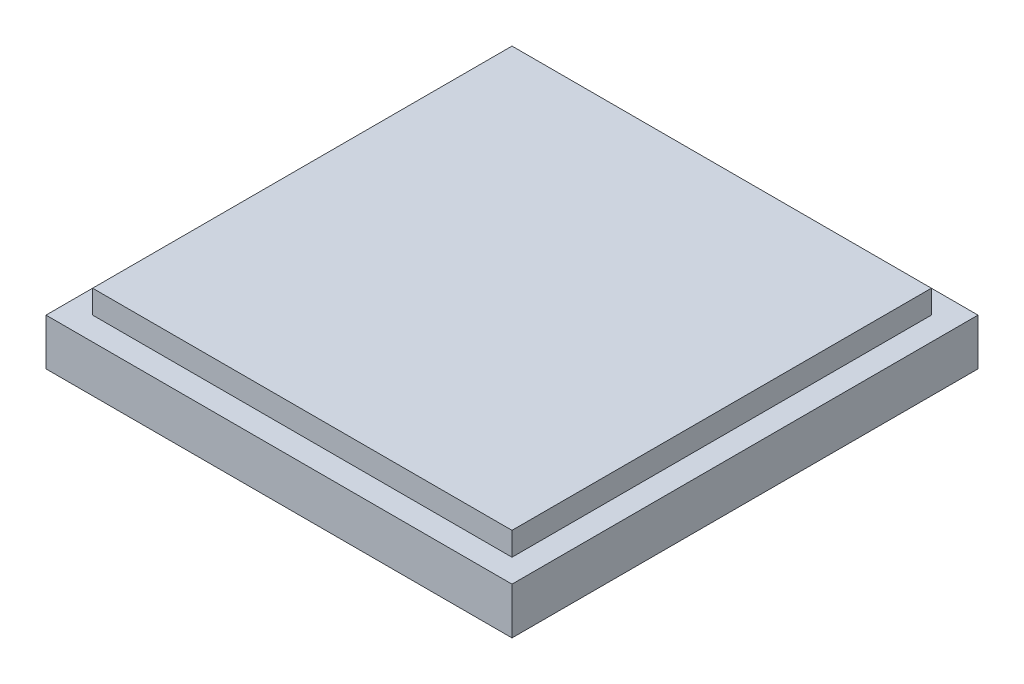
ISO-10303-21;
HEADER;
FILE_DESCRIPTION(('STEP AP214'),'2;1');
FILE_NAME('part.step','',(''),(''),'','','');
FILE_SCHEMA(('AUTOMOTIVE_DESIGN { 1 0 10303 214 1 1 1 1 }'));
ENDSEC;
DATA;
#1=APPLICATION_CONTEXT('core data for automotive mechanical design processes');
#2=APPLICATION_PROTOCOL_DEFINITION('international standard','automotive_design',2000,#1);
#3=PRODUCT_CONTEXT('',#1,'mechanical');
#4=PRODUCT('Part','Part','',(#3));
#5=PRODUCT_RELATED_PRODUCT_CATEGORY('part','',(#4));
#6=PRODUCT_DEFINITION_FORMATION('','',#4);
#7=PRODUCT_DEFINITION_CONTEXT('part definition',#1,'design');
#8=PRODUCT_DEFINITION('design','',#6,#7);
#9=PRODUCT_DEFINITION_SHAPE('','',#8);
#10=(LENGTH_UNIT() NAMED_UNIT(*) SI_UNIT(.MILLI.,.METRE.));
#11=(NAMED_UNIT(*) PLANE_ANGLE_UNIT() SI_UNIT($,.RADIAN.));
#12=(NAMED_UNIT(*) SI_UNIT($,.STERADIAN.) SOLID_ANGLE_UNIT());
#13=UNCERTAINTY_MEASURE_WITH_UNIT(LENGTH_MEASURE(1.E-05),#10,'distance_accuracy_value','');
#14=(GEOMETRIC_REPRESENTATION_CONTEXT(3) GLOBAL_UNCERTAINTY_ASSIGNED_CONTEXT((#13)) GLOBAL_UNIT_ASSIGNED_CONTEXT((#10,
#11,#12)) REPRESENTATION_CONTEXT('',''));
#15=CARTESIAN_POINT('',(0.,0.,0.));
#16=DIRECTION('',(0.,0.,1.));
#17=DIRECTION('',(1.,0.,0.));
#18=AXIS2_PLACEMENT_3D('',#15,#16,#17);
#19=CARTESIAN_POINT('',(-25.,5.,25.));
#20=DIRECTION('',(1.,0.,0.));
#21=DIRECTION('',(0.,0.,-1.));
#22=AXIS2_PLACEMENT_3D('',#19,#20,#21);
#23=PLANE('',#22);
#24=DIRECTION('',(0.,0.,1.));
#25=VECTOR('',#24,1.);
#26=CARTESIAN_POINT('',(-25.,0.,25.));
#27=LINE('',#26,#25);
#28=CARTESIAN_POINT('',(-25.,0.,-25.));
#29=VERTEX_POINT('',#28);
#30=CARTESIAN_POINT('',(-25.,0.,25.));
#31=VERTEX_POINT('',#30);
#32=EDGE_CURVE('E127',#29,#31,#27,.T.);
#33=ORIENTED_EDGE('',*,*,#32,.T.);
#34=DIRECTION('',(0.,-1.,0.));
#35=VECTOR('',#34,1.);
#36=CARTESIAN_POINT('',(-25.,5.,25.));
#37=LINE('',#36,#35);
#38=CARTESIAN_POINT('',(-25.,5.,25.));
#39=VERTEX_POINT('',#38);
#40=EDGE_CURVE('E11',#39,#31,#37,.T.);
#41=ORIENTED_EDGE('',*,*,#40,.F.);
#42=DIRECTION('',(0.,0.,1.));
#43=VECTOR('',#42,1.);
#44=CARTESIAN_POINT('',(-25.,5.,25.));
#45=LINE('',#44,#43);
#46=CARTESIAN_POINT('',(-25.,5.,-25.));
#47=VERTEX_POINT('',#46);
#48=EDGE_CURVE('E138',#47,#39,#45,.T.);
#49=ORIENTED_EDGE('',*,*,#48,.F.);
#50=DIRECTION('',(0.,-1.,0.));
#51=VECTOR('',#50,1.);
#52=CARTESIAN_POINT('',(-25.,5.,-25.));
#53=LINE('',#52,#51);
#54=EDGE_CURVE('E151',#47,#29,#53,.T.);
#55=ORIENTED_EDGE('',*,*,#54,.T.);
#56=EDGE_LOOP('',(#33,#41,#49,#55));
#57=FACE_BOUND('',#56,.T.);
#58=ADVANCED_FACE('F39',(#57),#23,.F.);
#59=CARTESIAN_POINT('',(25.,5.,25.));
#60=DIRECTION('',(0.,0.,-1.));
#61=DIRECTION('',(-1.,0.,0.));
#62=AXIS2_PLACEMENT_3D('',#59,#60,#61);
#63=PLANE('',#62);
#64=DIRECTION('',(1.,0.,0.));
#65=VECTOR('',#64,1.);
#66=CARTESIAN_POINT('',(25.,0.,25.));
#67=LINE('',#66,#65);
#68=CARTESIAN_POINT('',(25.,0.,25.));
#69=VERTEX_POINT('',#68);
#70=EDGE_CURVE('E132',#31,#69,#67,.T.);
#71=ORIENTED_EDGE('',*,*,#70,.T.);
#72=DIRECTION('',(0.,-1.,0.));
#73=VECTOR('',#72,1.);
#74=CARTESIAN_POINT('',(25.,5.,25.));
#75=LINE('',#74,#73);
#76=CARTESIAN_POINT('',(25.,5.,25.));
#77=VERTEX_POINT('',#76);
#78=EDGE_CURVE('E47',#77,#69,#75,.T.);
#79=ORIENTED_EDGE('',*,*,#78,.F.);
#80=DIRECTION('',(1.,0.,0.));
#81=VECTOR('',#80,1.);
#82=CARTESIAN_POINT('',(25.,5.,25.));
#83=LINE('',#82,#81);
#84=EDGE_CURVE('E142',#39,#77,#83,.T.);
#85=ORIENTED_EDGE('',*,*,#84,.F.);
#86=ORIENTED_EDGE('',*,*,#40,.T.);
#87=EDGE_LOOP('',(#71,#79,#85,#86));
#88=FACE_BOUND('',#87,.T.);
#89=ADVANCED_FACE('F188',(#88),#63,.F.);
#90=CARTESIAN_POINT('',(25.,5.,25.));
#91=DIRECTION('',(-1.,0.,0.));
#92=DIRECTION('',(0.,0.,1.));
#93=AXIS2_PLACEMENT_3D('',#90,#91,#92);
#94=PLANE('',#93);
#95=DIRECTION('',(0.,0.,-1.));
#96=VECTOR('',#95,1.);
#97=CARTESIAN_POINT('',(25.,0.,25.));
#98=LINE('',#97,#96);
#99=CARTESIAN_POINT('',(25.,0.,-25.));
#100=VERTEX_POINT('',#99);
#101=EDGE_CURVE('E155',#69,#100,#98,.T.);
#102=ORIENTED_EDGE('',*,*,#101,.T.);
#103=DIRECTION('',(0.,-1.,0.));
#104=VECTOR('',#103,1.);
#105=CARTESIAN_POINT('',(25.,5.,-25.));
#106=LINE('',#105,#104);
#107=CARTESIAN_POINT('',(25.,5.,-25.));
#108=VERTEX_POINT('',#107);
#109=EDGE_CURVE('E163',#108,#100,#106,.T.);
#110=ORIENTED_EDGE('',*,*,#109,.F.);
#111=DIRECTION('',(0.,0.,-1.));
#112=VECTOR('',#111,1.);
#113=CARTESIAN_POINT('',(25.,5.,25.));
#114=LINE('',#113,#112);
#115=EDGE_CURVE('E146',#77,#108,#114,.T.);
#116=ORIENTED_EDGE('',*,*,#115,.F.);
#117=ORIENTED_EDGE('',*,*,#78,.T.);
#118=EDGE_LOOP('',(#102,#110,#116,#117));
#119=FACE_BOUND('',#118,.T.);
#120=ADVANCED_FACE('F172',(#119),#94,.F.);
#121=CARTESIAN_POINT('',(25.,5.,-25.));
#122=DIRECTION('',(0.,0.,1.));
#123=DIRECTION('',(1.,0.,0.));
#124=AXIS2_PLACEMENT_3D('',#121,#122,#123);
#125=PLANE('',#124);
#126=DIRECTION('',(-1.,0.,0.));
#127=VECTOR('',#126,1.);
#128=CARTESIAN_POINT('',(25.,0.,-25.));
#129=LINE('',#128,#127);
#130=EDGE_CURVE('E143',#100,#29,#129,.T.);
#131=ORIENTED_EDGE('',*,*,#130,.T.);
#132=ORIENTED_EDGE('',*,*,#54,.F.);
#133=DIRECTION('',(-1.,0.,0.));
#134=VECTOR('',#133,1.);
#135=CARTESIAN_POINT('',(25.,5.,-25.));
#136=LINE('',#135,#134);
#137=EDGE_CURVE('E149',#108,#47,#136,.T.);
#138=ORIENTED_EDGE('',*,*,#137,.F.);
#139=ORIENTED_EDGE('',*,*,#109,.T.);
#140=EDGE_LOOP('',(#131,#132,#138,#139));
#141=FACE_BOUND('',#140,.T.);
#142=ADVANCED_FACE('F181',(#141),#125,.F.);
#143=CARTESIAN_POINT('',(0.,5.,0.));
#144=DIRECTION('',(0.,1.,0.));
#145=DIRECTION('',(0.,0.,1.));
#146=AXIS2_PLACEMENT_3D('',#143,#144,#145);
#147=PLANE('',#146);
#148=DIRECTION('',(0.,0.,1.));
#149=VECTOR('',#148,1.);
#150=CARTESIAN_POINT('',(-22.5,5.,22.5));
#151=LINE('',#150,#149);
#152=CARTESIAN_POINT('',(-22.5,5.,-22.5));
#153=VERTEX_POINT('',#152);
#154=CARTESIAN_POINT('',(-22.5,5.,22.5));
#155=VERTEX_POINT('',#154);
#156=EDGE_CURVE('E54',#153,#155,#151,.T.);
#157=ORIENTED_EDGE('',*,*,#156,.F.);
#158=DIRECTION('',(-1.,0.,0.));
#159=VECTOR('',#158,1.);
#160=CARTESIAN_POINT('',(22.5,5.,-22.5));
#161=LINE('',#160,#159);
#162=CARTESIAN_POINT('',(22.5,5.,-22.5));
#163=VERTEX_POINT('',#162);
#164=EDGE_CURVE('E58',#163,#153,#161,.T.);
#165=ORIENTED_EDGE('',*,*,#164,.F.);
#166=DIRECTION('',(0.,0.,-1.));
#167=VECTOR('',#166,1.);
#168=CARTESIAN_POINT('',(22.5,5.,22.5));
#169=LINE('',#168,#167);
#170=CARTESIAN_POINT('',(22.5,5.,22.5));
#171=VERTEX_POINT('',#170);
#172=EDGE_CURVE('E283',#171,#163,#169,.T.);
#173=ORIENTED_EDGE('',*,*,#172,.F.);
#174=DIRECTION('',(1.,0.,0.));
#175=VECTOR('',#174,1.);
#176=CARTESIAN_POINT('',(22.5,5.,22.5));
#177=LINE('',#176,#175);
#178=EDGE_CURVE('E293',#155,#171,#177,.T.);
#179=ORIENTED_EDGE('',*,*,#178,.F.);
#180=EDGE_LOOP('',(#157,#165,#173,#179));
#181=FACE_BOUND('',#180,.T.);
#182=ORIENTED_EDGE('',*,*,#48,.T.);
#183=ORIENTED_EDGE('',*,*,#84,.T.);
#184=ORIENTED_EDGE('',*,*,#115,.T.);
#185=ORIENTED_EDGE('',*,*,#137,.T.);
#186=EDGE_LOOP('',(#182,#183,#184,#185));
#187=FACE_BOUND('',#186,.T.);
#188=ADVANCED_FACE('F187',(#181,#187),#147,.T.);
#189=CARTESIAN_POINT('',(0.,0.,0.));
#190=DIRECTION('',(0.,1.,0.));
#191=DIRECTION('',(0.,0.,1.));
#192=AXIS2_PLACEMENT_3D('',#189,#190,#191);
#193=PLANE('',#192);
#194=ORIENTED_EDGE('',*,*,#32,.F.);
#195=ORIENTED_EDGE('',*,*,#130,.F.);
#196=ORIENTED_EDGE('',*,*,#101,.F.);
#197=ORIENTED_EDGE('',*,*,#70,.F.);
#198=EDGE_LOOP('',(#194,#195,#196,#197));
#199=FACE_BOUND('',#198,.T.);
#200=ADVANCED_FACE('F178',(#199),#193,.F.);
#201=CARTESIAN_POINT('',(-22.5,7.5,22.5));
#202=DIRECTION('',(1.,0.,0.));
#203=DIRECTION('',(0.,0.,-1.));
#204=AXIS2_PLACEMENT_3D('',#201,#202,#203);
#205=PLANE('',#204);
#206=ORIENTED_EDGE('',*,*,#156,.T.);
#207=DIRECTION('',(0.,-1.,0.));
#208=VECTOR('',#207,1.);
#209=CARTESIAN_POINT('',(-22.5,7.5,22.5));
#210=LINE('',#209,#208);
#211=CARTESIAN_POINT('',(-22.5,7.5,22.5));
#212=VERTEX_POINT('',#211);
#213=EDGE_CURVE('E107',#212,#155,#210,.T.);
#214=ORIENTED_EDGE('',*,*,#213,.F.);
#215=DIRECTION('',(0.,0.,1.));
#216=VECTOR('',#215,1.);
#217=CARTESIAN_POINT('',(-22.5,7.5,22.5));
#218=LINE('',#217,#216);
#219=CARTESIAN_POINT('',(-22.5,7.5,-22.5));
#220=VERTEX_POINT('',#219);
#221=EDGE_CURVE('E114',#220,#212,#218,.T.);
#222=ORIENTED_EDGE('',*,*,#221,.F.);
#223=DIRECTION('',(0.,-1.,0.));
#224=VECTOR('',#223,1.);
#225=CARTESIAN_POINT('',(-22.5,7.5,-22.5));
#226=LINE('',#225,#224);
#227=EDGE_CURVE('E280',#220,#153,#226,.T.);
#228=ORIENTED_EDGE('',*,*,#227,.T.);
#229=EDGE_LOOP('',(#206,#214,#222,#228));
#230=FACE_BOUND('',#229,.T.);
#231=ADVANCED_FACE('F125',(#230),#205,.F.);
#232=CARTESIAN_POINT('',(22.5,7.5,22.5));
#233=DIRECTION('',(0.,0.,-1.));
#234=DIRECTION('',(-1.,0.,0.));
#235=AXIS2_PLACEMENT_3D('',#232,#233,#234);
#236=PLANE('',#235);
#237=ORIENTED_EDGE('',*,*,#178,.T.);
#238=DIRECTION('',(0.,-1.,0.));
#239=VECTOR('',#238,1.);
#240=CARTESIAN_POINT('',(22.5,7.5,22.5));
#241=LINE('',#240,#239);
#242=CARTESIAN_POINT('',(22.5,7.5,22.5));
#243=VERTEX_POINT('',#242);
#244=EDGE_CURVE('E109',#243,#171,#241,.T.);
#245=ORIENTED_EDGE('',*,*,#244,.F.);
#246=DIRECTION('',(1.,0.,0.));
#247=VECTOR('',#246,1.);
#248=CARTESIAN_POINT('',(22.5,7.5,22.5));
#249=LINE('',#248,#247);
#250=EDGE_CURVE('E102',#212,#243,#249,.T.);
#251=ORIENTED_EDGE('',*,*,#250,.F.);
#252=ORIENTED_EDGE('',*,*,#213,.T.);
#253=EDGE_LOOP('',(#237,#245,#251,#252));
#254=FACE_BOUND('',#253,.T.);
#255=ADVANCED_FACE('F105',(#254),#236,.F.);
#256=CARTESIAN_POINT('',(22.5,7.5,22.5));
#257=DIRECTION('',(-1.,0.,0.));
#258=DIRECTION('',(0.,0.,1.));
#259=AXIS2_PLACEMENT_3D('',#256,#257,#258);
#260=PLANE('',#259);
#261=ORIENTED_EDGE('',*,*,#172,.T.);
#262=DIRECTION('',(0.,-1.,0.));
#263=VECTOR('',#262,1.);
#264=CARTESIAN_POINT('',(22.5,7.5,-22.5));
#265=LINE('',#264,#263);
#266=CARTESIAN_POINT('',(22.5,7.5,-22.5));
#267=VERTEX_POINT('',#266);
#268=EDGE_CURVE('E134',#267,#163,#265,.T.);
#269=ORIENTED_EDGE('',*,*,#268,.F.);
#270=DIRECTION('',(0.,0.,-1.));
#271=VECTOR('',#270,1.);
#272=CARTESIAN_POINT('',(22.5,7.5,22.5));
#273=LINE('',#272,#271);
#274=EDGE_CURVE('E113',#243,#267,#273,.T.);
#275=ORIENTED_EDGE('',*,*,#274,.F.);
#276=ORIENTED_EDGE('',*,*,#244,.T.);
#277=EDGE_LOOP('',(#261,#269,#275,#276));
#278=FACE_BOUND('',#277,.T.);
#279=ADVANCED_FACE('F206',(#278),#260,.F.);
#280=CARTESIAN_POINT('',(22.5,7.5,-22.5));
#281=DIRECTION('',(0.,0.,1.));
#282=DIRECTION('',(1.,0.,0.));
#283=AXIS2_PLACEMENT_3D('',#280,#281,#282);
#284=PLANE('',#283);
#285=ORIENTED_EDGE('',*,*,#164,.T.);
#286=ORIENTED_EDGE('',*,*,#227,.F.);
#287=DIRECTION('',(-1.,0.,0.));
#288=VECTOR('',#287,1.);
#289=CARTESIAN_POINT('',(22.5,7.5,-22.5));
#290=LINE('',#289,#288);
#291=EDGE_CURVE('E119',#267,#220,#290,.T.);
#292=ORIENTED_EDGE('',*,*,#291,.F.);
#293=ORIENTED_EDGE('',*,*,#268,.T.);
#294=EDGE_LOOP('',(#285,#286,#292,#293));
#295=FACE_BOUND('',#294,.T.);
#296=ADVANCED_FACE('F209',(#295),#284,.F.);
#297=CARTESIAN_POINT('',(0.,7.5,0.));
#298=DIRECTION('',(0.,1.,0.));
#299=DIRECTION('',(0.,0.,1.));
#300=AXIS2_PLACEMENT_3D('',#297,#298,#299);
#301=PLANE('',#300);
#302=ORIENTED_EDGE('',*,*,#221,.T.);
#303=ORIENTED_EDGE('',*,*,#250,.T.);
#304=ORIENTED_EDGE('',*,*,#274,.T.);
#305=ORIENTED_EDGE('',*,*,#291,.T.);
#306=EDGE_LOOP('',(#302,#303,#304,#305));
#307=FACE_BOUND('',#306,.T.);
#308=ADVANCED_FACE('F117',(#307),#301,.T.);
#309=CLOSED_SHELL('',(#58,#89,#120,#142,#188,#200,#231,#255,#279,#296,#308));
#310=MANIFOLD_SOLID_BREP('B2',#309);
#311=ADVANCED_BREP_SHAPE_REPRESENTATION('',(#18,#310),#14);
#312=SHAPE_DEFINITION_REPRESENTATION(#9,#311);
ENDSEC;
END-ISO-10303-21;
